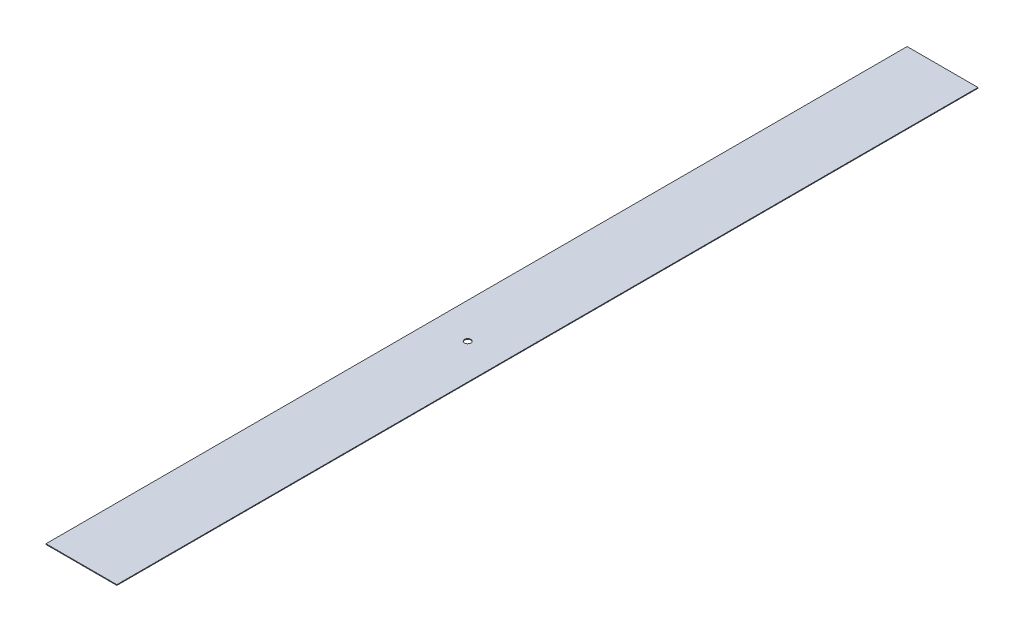
ISO-10303-21;
HEADER;
FILE_DESCRIPTION(('STEP AP214'),'2;1');
FILE_NAME('part.step','',(''),(''),'','','');
FILE_SCHEMA(('AUTOMOTIVE_DESIGN { 1 0 10303 214 1 1 1 1 }'));
ENDSEC;
DATA;
#1=APPLICATION_CONTEXT('core data for automotive mechanical design processes');
#2=APPLICATION_PROTOCOL_DEFINITION('international standard','automotive_design',2000,#1);
#3=PRODUCT_CONTEXT('',#1,'mechanical');
#4=PRODUCT('Part','Part','',(#3));
#5=PRODUCT_RELATED_PRODUCT_CATEGORY('part','',(#4));
#6=PRODUCT_DEFINITION_FORMATION('','',#4);
#7=PRODUCT_DEFINITION_CONTEXT('part definition',#1,'design');
#8=PRODUCT_DEFINITION('design','',#6,#7);
#9=PRODUCT_DEFINITION_SHAPE('','',#8);
#10=(LENGTH_UNIT() NAMED_UNIT(*) SI_UNIT(.MILLI.,.METRE.));
#11=(NAMED_UNIT(*) PLANE_ANGLE_UNIT() SI_UNIT($,.RADIAN.));
#12=(NAMED_UNIT(*) SI_UNIT($,.STERADIAN.) SOLID_ANGLE_UNIT());
#13=UNCERTAINTY_MEASURE_WITH_UNIT(LENGTH_MEASURE(1.E-05),#10,'distance_accuracy_value','');
#14=(GEOMETRIC_REPRESENTATION_CONTEXT(3) GLOBAL_UNCERTAINTY_ASSIGNED_CONTEXT((#13)) GLOBAL_UNIT_ASSIGNED_CONTEXT((#10,
#11,#12)) REPRESENTATION_CONTEXT('',''));
#15=CARTESIAN_POINT('',(0.,0.,0.));
#16=DIRECTION('',(0.,0.,1.));
#17=DIRECTION('',(1.,0.,0.));
#18=AXIS2_PLACEMENT_3D('',#15,#16,#17);
#19=CARTESIAN_POINT('',(200.,-2.,0.));
#20=DIRECTION('',(-1.,0.,0.));
#21=DIRECTION('',(0.,0.,1.));
#22=AXIS2_PLACEMENT_3D('',#19,#20,#21);
#23=PLANE('',#22);
#24=DIRECTION('',(0.,1.,0.));
#25=VECTOR('',#24,1.);
#26=CARTESIAN_POINT('',(200.,-10.,2430.));
#27=LINE('',#26,#25);
#28=CARTESIAN_POINT('',(200.,-2.,2430.));
#29=VERTEX_POINT('',#28);
#30=CARTESIAN_POINT('',(200.,0.,2430.));
#31=VERTEX_POINT('',#30);
#32=EDGE_CURVE('E56',#29,#31,#27,.T.);
#33=ORIENTED_EDGE('',*,*,#32,.F.);
#34=DIRECTION('',(0.,0.,-1.));
#35=VECTOR('',#34,1.);
#36=CARTESIAN_POINT('',(200.,-2.,985.));
#37=LINE('',#36,#35);
#38=CARTESIAN_POINT('',(200.,-2.,0.));
#39=VERTEX_POINT('',#38);
#40=EDGE_CURVE('E109',#29,#39,#37,.T.);
#41=ORIENTED_EDGE('',*,*,#40,.T.);
#42=DIRECTION('',(0.,1.,0.));
#43=VECTOR('',#42,1.);
#44=CARTESIAN_POINT('',(200.,-1.,0.));
#45=LINE('',#44,#43);
#46=CARTESIAN_POINT('',(200.,0.,0.));
#47=VERTEX_POINT('',#46);
#48=EDGE_CURVE('E42',#39,#47,#45,.T.);
#49=ORIENTED_EDGE('',*,*,#48,.T.);
#50=DIRECTION('',(0.,0.,1.));
#51=VECTOR('',#50,1.);
#52=CARTESIAN_POINT('',(200.,0.,985.));
#53=LINE('',#52,#51);
#54=EDGE_CURVE('E97',#47,#31,#53,.T.);
#55=ORIENTED_EDGE('',*,*,#54,.T.);
#56=EDGE_LOOP('',(#33,#41,#49,#55));
#57=FACE_BOUND('',#56,.T.);
#58=ADVANCED_FACE('F38',(#57),#23,.F.);
#59=CARTESIAN_POINT('',(0.,-2.,0.));
#60=DIRECTION('',(1.,0.,0.));
#61=DIRECTION('',(0.,1.,0.));
#62=AXIS2_PLACEMENT_3D('',#59,#60,#61);
#63=PLANE('',#62);
#64=DIRECTION('',(0.,-1.,0.));
#65=VECTOR('',#64,1.);
#66=CARTESIAN_POINT('',(0.,-2.,2430.));
#67=LINE('',#66,#65);
#68=CARTESIAN_POINT('',(0.,0.,2430.));
#69=VERTEX_POINT('',#68);
#70=CARTESIAN_POINT('',(0.,-2.,2430.));
#71=VERTEX_POINT('',#70);
#72=EDGE_CURVE('E83',#69,#71,#67,.T.);
#73=ORIENTED_EDGE('',*,*,#72,.F.);
#74=DIRECTION('',(0.,0.,-1.));
#75=VECTOR('',#74,1.);
#76=CARTESIAN_POINT('',(0.,0.,985.));
#77=LINE('',#76,#75);
#78=CARTESIAN_POINT('',(0.,0.,0.));
#79=VERTEX_POINT('',#78);
#80=EDGE_CURVE('E48',#69,#79,#77,.T.);
#81=ORIENTED_EDGE('',*,*,#80,.T.);
#82=DIRECTION('',(0.,-1.,0.));
#83=VECTOR('',#82,1.);
#84=CARTESIAN_POINT('',(0.,-1.,0.));
#85=LINE('',#84,#83);
#86=CARTESIAN_POINT('',(0.,-2.,0.));
#87=VERTEX_POINT('',#86);
#88=EDGE_CURVE('E113',#79,#87,#85,.T.);
#89=ORIENTED_EDGE('',*,*,#88,.T.);
#90=DIRECTION('',(0.,0.,1.));
#91=VECTOR('',#90,1.);
#92=CARTESIAN_POINT('',(0.,-2.,985.));
#93=LINE('',#92,#91);
#94=EDGE_CURVE('E80',#87,#71,#93,.T.);
#95=ORIENTED_EDGE('',*,*,#94,.T.);
#96=EDGE_LOOP('',(#73,#81,#89,#95));
#97=FACE_BOUND('',#96,.T.);
#98=ADVANCED_FACE('F93',(#97),#63,.F.);
#99=CARTESIAN_POINT('',(0.,-2.,0.));
#100=DIRECTION('',(0.,1.,0.));
#101=DIRECTION('',(0.,0.,1.));
#102=AXIS2_PLACEMENT_3D('',#99,#100,#101);
#103=PLANE('',#102);
#104=CARTESIAN_POINT('',(100.,-2.,1340.));
#105=DIRECTION('',(0.,-1.,0.));
#106=DIRECTION('',(0.,0.,-1.));
#107=AXIS2_PLACEMENT_3D('',#104,#105,#106);
#108=CIRCLE('',#107,9.00000000000001);
#109=CARTESIAN_POINT('',(100.,-2.,1331.));
#110=VERTEX_POINT('',#109);
#111=EDGE_CURVE('E131',#110,#110,#108,.T.);
#112=ORIENTED_EDGE('',*,*,#111,.F.);
#113=EDGE_LOOP('',(#112));
#114=FACE_BOUND('',#113,.T.);
#115=DIRECTION('',(1.,0.,0.));
#116=VECTOR('',#115,1.);
#117=CARTESIAN_POINT('',(0.,-2.,2430.));
#118=LINE('',#117,#116);
#119=EDGE_CURVE('E85',#71,#29,#118,.T.);
#120=ORIENTED_EDGE('',*,*,#119,.F.);
#121=ORIENTED_EDGE('',*,*,#94,.F.);
#122=DIRECTION('',(-1.,0.,0.));
#123=VECTOR('',#122,1.);
#124=CARTESIAN_POINT('',(100.,-2.,0.));
#125=LINE('',#124,#123);
#126=EDGE_CURVE('E103',#39,#87,#125,.T.);
#127=ORIENTED_EDGE('',*,*,#126,.F.);
#128=ORIENTED_EDGE('',*,*,#40,.F.);
#129=EDGE_LOOP('',(#120,#121,#127,#128));
#130=FACE_BOUND('',#129,.T.);
#131=ADVANCED_FACE('F127',(#114,#130),#103,.F.);
#132=CARTESIAN_POINT('',(0.,0.,1970.));
#133=DIRECTION('',(0.,-1.,0.));
#134=DIRECTION('',(0.,0.,-1.));
#135=AXIS2_PLACEMENT_3D('',#132,#133,#134);
#136=PLANE('',#135);
#137=CARTESIAN_POINT('',(100.,0.,1340.));
#138=DIRECTION('',(0.,-1.,0.));
#139=DIRECTION('',(0.,0.,-1.));
#140=AXIS2_PLACEMENT_3D('',#137,#138,#139);
#141=CIRCLE('',#140,9.00000000000001);
#142=CARTESIAN_POINT('',(100.,0.,1331.));
#143=VERTEX_POINT('',#142);
#144=EDGE_CURVE('E91',#143,#143,#141,.T.);
#145=ORIENTED_EDGE('',*,*,#144,.T.);
#146=EDGE_LOOP('',(#145));
#147=FACE_BOUND('',#146,.T.);
#148=DIRECTION('',(1.,0.,0.));
#149=VECTOR('',#148,1.);
#150=CARTESIAN_POINT('',(-154.658037953027,0.,2430.));
#151=LINE('',#150,#149);
#152=EDGE_CURVE('E87',#69,#31,#151,.T.);
#153=ORIENTED_EDGE('',*,*,#152,.T.);
#154=ORIENTED_EDGE('',*,*,#54,.F.);
#155=DIRECTION('',(1.,0.,0.));
#156=VECTOR('',#155,1.);
#157=CARTESIAN_POINT('',(100.,0.,0.));
#158=LINE('',#157,#156);
#159=EDGE_CURVE('E11',#79,#47,#158,.T.);
#160=ORIENTED_EDGE('',*,*,#159,.F.);
#161=ORIENTED_EDGE('',*,*,#80,.F.);
#162=EDGE_LOOP('',(#153,#154,#160,#161));
#163=FACE_BOUND('',#162,.T.);
#164=ADVANCED_FACE('F40',(#147,#163),#136,.F.);
#165=CARTESIAN_POINT('',(0.,-2.,0.));
#166=DIRECTION('',(0.,0.,1.));
#167=DIRECTION('',(1.,0.,0.));
#168=AXIS2_PLACEMENT_3D('',#165,#166,#167);
#169=PLANE('',#168);
#170=ORIENTED_EDGE('',*,*,#159,.T.);
#171=ORIENTED_EDGE('',*,*,#48,.F.);
#172=ORIENTED_EDGE('',*,*,#126,.T.);
#173=ORIENTED_EDGE('',*,*,#88,.F.);
#174=EDGE_LOOP('',(#170,#171,#172,#173));
#175=FACE_BOUND('',#174,.T.);
#176=ADVANCED_FACE('F126',(#175),#169,.F.);
#177=CARTESIAN_POINT('',(-154.658037953027,-10.,2430.));
#178=DIRECTION('',(0.,0.,1.));
#179=DIRECTION('',(1.,0.,0.));
#180=AXIS2_PLACEMENT_3D('',#177,#178,#179);
#181=PLANE('',#180);
#182=ORIENTED_EDGE('',*,*,#72,.T.);
#183=ORIENTED_EDGE('',*,*,#119,.T.);
#184=ORIENTED_EDGE('',*,*,#32,.T.);
#185=ORIENTED_EDGE('',*,*,#152,.F.);
#186=EDGE_LOOP('',(#182,#183,#184,#185));
#187=FACE_BOUND('',#186,.T.);
#188=ADVANCED_FACE('F88',(#187),#181,.T.);
#189=CARTESIAN_POINT('',(100.,0.,1340.));
#190=DIRECTION('',(0.,-1.,0.));
#191=DIRECTION('',(0.,0.,-1.));
#192=AXIS2_PLACEMENT_3D('',#189,#190,#191);
#193=CYLINDRICAL_SURFACE('',#192,9.00000000000001);
#194=ORIENTED_EDGE('',*,*,#144,.F.);
#195=EDGE_LOOP('',(#194));
#196=FACE_BOUND('',#195,.T.);
#197=ORIENTED_EDGE('',*,*,#111,.T.);
#198=EDGE_LOOP('',(#197));
#199=FACE_BOUND('',#198,.T.);
#200=ADVANCED_FACE('F138',(#196,#199),#193,.F.);
#201=CLOSED_SHELL('',(#58,#98,#131,#164,#176,#188,#200));
#202=MANIFOLD_SOLID_BREP('B2',#201);
#203=ADVANCED_BREP_SHAPE_REPRESENTATION('',(#18,#202),#14);
#204=SHAPE_DEFINITION_REPRESENTATION(#9,#203);
ENDSEC;
END-ISO-10303-21;
